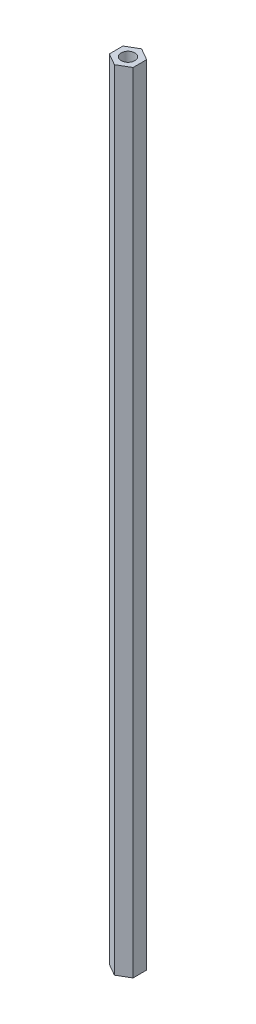
ISO-10303-21;
HEADER;
FILE_DESCRIPTION(('STEP AP214'),'2;1');
FILE_NAME('part.step','',(''),(''),'','','');
FILE_SCHEMA(('AUTOMOTIVE_DESIGN { 1 0 10303 214 1 1 1 1 }'));
ENDSEC;
DATA;
#1=APPLICATION_CONTEXT('core data for automotive mechanical design processes');
#2=APPLICATION_PROTOCOL_DEFINITION('international standard','automotive_design',2000,#1);
#3=PRODUCT_CONTEXT('',#1,'mechanical');
#4=PRODUCT('Part','Part','',(#3));
#5=PRODUCT_RELATED_PRODUCT_CATEGORY('part','',(#4));
#6=PRODUCT_DEFINITION_FORMATION('','',#4);
#7=PRODUCT_DEFINITION_CONTEXT('part definition',#1,'design');
#8=PRODUCT_DEFINITION('design','',#6,#7);
#9=PRODUCT_DEFINITION_SHAPE('','',#8);
#10=(LENGTH_UNIT() NAMED_UNIT(*) SI_UNIT(.MILLI.,.METRE.));
#11=(NAMED_UNIT(*) PLANE_ANGLE_UNIT() SI_UNIT($,.RADIAN.));
#12=(NAMED_UNIT(*) SI_UNIT($,.STERADIAN.) SOLID_ANGLE_UNIT());
#13=UNCERTAINTY_MEASURE_WITH_UNIT(LENGTH_MEASURE(1.E-05),#10,'distance_accuracy_value','');
#14=(GEOMETRIC_REPRESENTATION_CONTEXT(3) GLOBAL_UNCERTAINTY_ASSIGNED_CONTEXT((#13)) GLOBAL_UNIT_ASSIGNED_CONTEXT((#10,
#11,#12)) REPRESENTATION_CONTEXT('',''));
#15=CARTESIAN_POINT('',(0.,0.,0.));
#16=DIRECTION('',(0.,0.,1.));
#17=DIRECTION('',(1.,0.,0.));
#18=AXIS2_PLACEMENT_3D('',#15,#16,#17);
#19=CARTESIAN_POINT('',(0.,289.,-5.));
#20=DIRECTION('',(0.,1.,0.));
#21=DIRECTION('',(0.,0.,1.));
#22=AXIS2_PLACEMENT_3D('',#19,#20,#21);
#23=PLANE('',#22);
#24=DIRECTION('',(-0.866025403784439,0.,-0.5));
#25=VECTOR('',#24,1.);
#26=CARTESIAN_POINT('',(4.33012701892219,289.,-2.5));
#27=LINE('',#26,#25);
#28=CARTESIAN_POINT('',(4.33012701892219,289.,-2.5));
#29=VERTEX_POINT('',#28);
#30=CARTESIAN_POINT('',(0.,289.,-5.));
#31=VERTEX_POINT('',#30);
#32=EDGE_CURVE('E127',#29,#31,#27,.T.);
#33=ORIENTED_EDGE('',*,*,#32,.T.);
#34=DIRECTION('',(-0.866025403784439,0.,0.5));
#35=VECTOR('',#34,1.);
#36=CARTESIAN_POINT('',(0.,289.,-5.));
#37=LINE('',#36,#35);
#38=CARTESIAN_POINT('',(-4.33012701892219,289.,-2.5));
#39=VERTEX_POINT('',#38);
#40=EDGE_CURVE('E85',#31,#39,#37,.T.);
#41=ORIENTED_EDGE('',*,*,#40,.T.);
#42=DIRECTION('',(0.,0.,1.));
#43=VECTOR('',#42,1.);
#44=CARTESIAN_POINT('',(-4.33012701892219,289.,-2.5));
#45=LINE('',#44,#43);
#46=CARTESIAN_POINT('',(-4.33012701892219,289.,2.5));
#47=VERTEX_POINT('',#46);
#48=EDGE_CURVE('E98',#39,#47,#45,.T.);
#49=ORIENTED_EDGE('',*,*,#48,.T.);
#50=DIRECTION('',(0.866025403784439,0.,0.5));
#51=VECTOR('',#50,1.);
#52=CARTESIAN_POINT('',(-4.33012701892219,289.,2.5));
#53=LINE('',#52,#51);
#54=CARTESIAN_POINT('',(0.,289.,5.));
#55=VERTEX_POINT('',#54);
#56=EDGE_CURVE('E92',#47,#55,#53,.T.);
#57=ORIENTED_EDGE('',*,*,#56,.T.);
#58=DIRECTION('',(0.866025403784439,0.,-0.5));
#59=VECTOR('',#58,1.);
#60=CARTESIAN_POINT('',(0.,289.,5.));
#61=LINE('',#60,#59);
#62=CARTESIAN_POINT('',(4.33012701892219,289.,2.5));
#63=VERTEX_POINT('',#62);
#64=EDGE_CURVE('E96',#55,#63,#61,.T.);
#65=ORIENTED_EDGE('',*,*,#64,.T.);
#66=DIRECTION('',(0.,0.,-1.));
#67=VECTOR('',#66,1.);
#68=CARTESIAN_POINT('',(4.33012701892219,289.,2.5));
#69=LINE('',#68,#67);
#70=EDGE_CURVE('E48',#63,#29,#69,.T.);
#71=ORIENTED_EDGE('',*,*,#70,.T.);
#72=EDGE_LOOP('',(#33,#41,#49,#57,#65,#71));
#73=FACE_BOUND('',#72,.T.);
#74=CARTESIAN_POINT('',(0.,289.,0.));
#75=DIRECTION('',(0.,1.,0.));
#76=DIRECTION('',(0.,0.,1.));
#77=AXIS2_PLACEMENT_3D('',#74,#75,#76);
#78=CIRCLE('',#77,2.5);
#79=CARTESIAN_POINT('',(0.,289.,2.5));
#80=VERTEX_POINT('',#79);
#81=EDGE_CURVE('E120',#80,#80,#78,.T.);
#82=ORIENTED_EDGE('',*,*,#81,.F.);
#83=EDGE_LOOP('',(#82));
#84=FACE_BOUND('',#83,.T.);
#85=ADVANCED_FACE('F31',(#73,#84),#23,.T.);
#86=CARTESIAN_POINT('',(0.,0.,-5.));
#87=DIRECTION('',(0.,1.,0.));
#88=DIRECTION('',(0.,0.,1.));
#89=AXIS2_PLACEMENT_3D('',#86,#87,#88);
#90=PLANE('',#89);
#91=DIRECTION('',(-0.866025403784439,0.,-0.5));
#92=VECTOR('',#91,1.);
#93=CARTESIAN_POINT('',(4.33012701892219,0.,-2.5));
#94=LINE('',#93,#92);
#95=CARTESIAN_POINT('',(4.33012701892219,0.,-2.5));
#96=VERTEX_POINT('',#95);
#97=CARTESIAN_POINT('',(0.,0.,-5.));
#98=VERTEX_POINT('',#97);
#99=EDGE_CURVE('E116',#96,#98,#94,.T.);
#100=ORIENTED_EDGE('',*,*,#99,.F.);
#101=DIRECTION('',(0.,0.,-1.));
#102=VECTOR('',#101,1.);
#103=CARTESIAN_POINT('',(4.33012701892219,0.,2.5));
#104=LINE('',#103,#102);
#105=CARTESIAN_POINT('',(4.33012701892219,0.,2.5));
#106=VERTEX_POINT('',#105);
#107=EDGE_CURVE('E77',#106,#96,#104,.T.);
#108=ORIENTED_EDGE('',*,*,#107,.F.);
#109=DIRECTION('',(0.866025403784439,0.,-0.5));
#110=VECTOR('',#109,1.);
#111=CARTESIAN_POINT('',(0.,0.,5.));
#112=LINE('',#111,#110);
#113=CARTESIAN_POINT('',(0.,0.,5.));
#114=VERTEX_POINT('',#113);
#115=EDGE_CURVE('E71',#114,#106,#112,.T.);
#116=ORIENTED_EDGE('',*,*,#115,.F.);
#117=DIRECTION('',(0.866025403784439,0.,0.5));
#118=VECTOR('',#117,1.);
#119=CARTESIAN_POINT('',(-4.33012701892219,0.,2.5));
#120=LINE('',#119,#118);
#121=CARTESIAN_POINT('',(-4.33012701892219,0.,2.5));
#122=VERTEX_POINT('',#121);
#123=EDGE_CURVE('E106',#122,#114,#120,.T.);
#124=ORIENTED_EDGE('',*,*,#123,.F.);
#125=DIRECTION('',(0.,0.,1.));
#126=VECTOR('',#125,1.);
#127=CARTESIAN_POINT('',(-4.33012701892219,0.,-2.5));
#128=LINE('',#127,#126);
#129=CARTESIAN_POINT('',(-4.33012701892219,0.,-2.5));
#130=VERTEX_POINT('',#129);
#131=EDGE_CURVE('E122',#130,#122,#128,.T.);
#132=ORIENTED_EDGE('',*,*,#131,.F.);
#133=DIRECTION('',(-0.866025403784439,0.,0.5));
#134=VECTOR('',#133,1.);
#135=CARTESIAN_POINT('',(0.,0.,-5.));
#136=LINE('',#135,#134);
#137=EDGE_CURVE('E119',#98,#130,#136,.T.);
#138=ORIENTED_EDGE('',*,*,#137,.F.);
#139=EDGE_LOOP('',(#100,#108,#116,#124,#132,#138));
#140=FACE_BOUND('',#139,.T.);
#141=CARTESIAN_POINT('',(0.,0.,0.));
#142=DIRECTION('',(0.,1.,0.));
#143=DIRECTION('',(0.,0.,1.));
#144=AXIS2_PLACEMENT_3D('',#141,#142,#143);
#145=CIRCLE('',#144,2.5);
#146=CARTESIAN_POINT('',(0.,0.,2.5));
#147=VERTEX_POINT('',#146);
#148=EDGE_CURVE('E220',#147,#147,#145,.T.);
#149=ORIENTED_EDGE('',*,*,#148,.T.);
#150=EDGE_LOOP('',(#149));
#151=FACE_BOUND('',#150,.T.);
#152=ADVANCED_FACE('F136',(#140,#151),#90,.F.);
#153=CARTESIAN_POINT('',(4.33012701892219,289.,-2.5));
#154=DIRECTION('',(-0.5,0.,0.866025403784439));
#155=DIRECTION('',(0.866025403784439,0.,0.5));
#156=AXIS2_PLACEMENT_3D('',#153,#154,#155);
#157=PLANE('',#156);
#158=ORIENTED_EDGE('',*,*,#99,.T.);
#159=DIRECTION('',(0.,-1.,0.));
#160=VECTOR('',#159,1.);
#161=CARTESIAN_POINT('',(0.,289.,-5.));
#162=LINE('',#161,#160);
#163=EDGE_CURVE('E11',#31,#98,#162,.T.);
#164=ORIENTED_EDGE('',*,*,#163,.F.);
#165=ORIENTED_EDGE('',*,*,#32,.F.);
#166=DIRECTION('',(0.,-1.,0.));
#167=VECTOR('',#166,1.);
#168=CARTESIAN_POINT('',(4.33012701892219,289.,-2.5));
#169=LINE('',#168,#167);
#170=EDGE_CURVE('E112',#29,#96,#169,.T.);
#171=ORIENTED_EDGE('',*,*,#170,.T.);
#172=EDGE_LOOP('',(#158,#164,#165,#171));
#173=FACE_BOUND('',#172,.T.);
#174=ADVANCED_FACE('F33',(#173),#157,.F.);
#175=CARTESIAN_POINT('',(0.,289.,-5.));
#176=DIRECTION('',(0.5,0.,0.866025403784439));
#177=DIRECTION('',(0.866025403784439,0.,-0.5));
#178=AXIS2_PLACEMENT_3D('',#175,#176,#177);
#179=PLANE('',#178);
#180=ORIENTED_EDGE('',*,*,#137,.T.);
#181=DIRECTION('',(0.,-1.,0.));
#182=VECTOR('',#181,1.);
#183=CARTESIAN_POINT('',(-4.33012701892219,289.,-2.5));
#184=LINE('',#183,#182);
#185=EDGE_CURVE('E40',#39,#130,#184,.T.);
#186=ORIENTED_EDGE('',*,*,#185,.F.);
#187=ORIENTED_EDGE('',*,*,#40,.F.);
#188=ORIENTED_EDGE('',*,*,#163,.T.);
#189=EDGE_LOOP('',(#180,#186,#187,#188));
#190=FACE_BOUND('',#189,.T.);
#191=ADVANCED_FACE('F161',(#190),#179,.F.);
#192=CARTESIAN_POINT('',(-4.33012701892219,289.,-2.5));
#193=DIRECTION('',(1.,0.,0.));
#194=DIRECTION('',(0.,0.,-1.));
#195=AXIS2_PLACEMENT_3D('',#192,#193,#194);
#196=PLANE('',#195);
#197=ORIENTED_EDGE('',*,*,#131,.T.);
#198=DIRECTION('',(0.,-1.,0.));
#199=VECTOR('',#198,1.);
#200=CARTESIAN_POINT('',(-4.33012701892219,289.,2.5));
#201=LINE('',#200,#199);
#202=EDGE_CURVE('E107',#47,#122,#201,.T.);
#203=ORIENTED_EDGE('',*,*,#202,.F.);
#204=ORIENTED_EDGE('',*,*,#48,.F.);
#205=ORIENTED_EDGE('',*,*,#185,.T.);
#206=EDGE_LOOP('',(#197,#203,#204,#205));
#207=FACE_BOUND('',#206,.T.);
#208=ADVANCED_FACE('F133',(#207),#196,.F.);
#209=CARTESIAN_POINT('',(-4.33012701892219,289.,2.5));
#210=DIRECTION('',(0.5,0.,-0.866025403784439));
#211=DIRECTION('',(-0.866025403784439,0.,-0.5));
#212=AXIS2_PLACEMENT_3D('',#209,#210,#211);
#213=PLANE('',#212);
#214=ORIENTED_EDGE('',*,*,#123,.T.);
#215=DIRECTION('',(0.,-1.,0.));
#216=VECTOR('',#215,1.);
#217=CARTESIAN_POINT('',(0.,289.,5.));
#218=LINE('',#217,#216);
#219=EDGE_CURVE('E103',#55,#114,#218,.T.);
#220=ORIENTED_EDGE('',*,*,#219,.F.);
#221=ORIENTED_EDGE('',*,*,#56,.F.);
#222=ORIENTED_EDGE('',*,*,#202,.T.);
#223=EDGE_LOOP('',(#214,#220,#221,#222));
#224=FACE_BOUND('',#223,.T.);
#225=ADVANCED_FACE('F104',(#224),#213,.F.);
#226=CARTESIAN_POINT('',(0.,289.,5.));
#227=DIRECTION('',(-0.5,0.,-0.866025403784439));
#228=DIRECTION('',(-0.866025403784439,0.,0.5));
#229=AXIS2_PLACEMENT_3D('',#226,#227,#228);
#230=PLANE('',#229);
#231=ORIENTED_EDGE('',*,*,#115,.T.);
#232=DIRECTION('',(0.,-1.,0.));
#233=VECTOR('',#232,1.);
#234=CARTESIAN_POINT('',(4.33012701892219,289.,2.5));
#235=LINE('',#234,#233);
#236=EDGE_CURVE('E108',#63,#106,#235,.T.);
#237=ORIENTED_EDGE('',*,*,#236,.F.);
#238=ORIENTED_EDGE('',*,*,#64,.F.);
#239=ORIENTED_EDGE('',*,*,#219,.T.);
#240=EDGE_LOOP('',(#231,#237,#238,#239));
#241=FACE_BOUND('',#240,.T.);
#242=ADVANCED_FACE('F110',(#241),#230,.F.);
#243=CARTESIAN_POINT('',(4.33012701892219,289.,2.5));
#244=DIRECTION('',(-1.,0.,0.));
#245=DIRECTION('',(0.,0.,1.));
#246=AXIS2_PLACEMENT_3D('',#243,#244,#245);
#247=PLANE('',#246);
#248=ORIENTED_EDGE('',*,*,#107,.T.);
#249=ORIENTED_EDGE('',*,*,#170,.F.);
#250=ORIENTED_EDGE('',*,*,#70,.F.);
#251=ORIENTED_EDGE('',*,*,#236,.T.);
#252=EDGE_LOOP('',(#248,#249,#250,#251));
#253=FACE_BOUND('',#252,.T.);
#254=ADVANCED_FACE('F141',(#253),#247,.F.);
#255=CARTESIAN_POINT('',(0.,289.,0.));
#256=DIRECTION('',(0.,-1.,0.));
#257=DIRECTION('',(0.,0.,-1.));
#258=AXIS2_PLACEMENT_3D('',#255,#256,#257);
#259=CYLINDRICAL_SURFACE('',#258,2.5);
#260=ORIENTED_EDGE('',*,*,#81,.T.);
#261=EDGE_LOOP('',(#260));
#262=FACE_BOUND('',#261,.T.);
#263=ORIENTED_EDGE('',*,*,#148,.F.);
#264=EDGE_LOOP('',(#263));
#265=FACE_BOUND('',#264,.T.);
#266=ADVANCED_FACE('F143',(#262,#265),#259,.F.);
#267=CLOSED_SHELL('',(#85,#152,#174,#191,#208,#225,#242,#254,#266));
#268=MANIFOLD_SOLID_BREP('B2',#267);
#269=ADVANCED_BREP_SHAPE_REPRESENTATION('',(#18,#268),#14);
#270=SHAPE_DEFINITION_REPRESENTATION(#9,#269);
ENDSEC;
END-ISO-10303-21;
